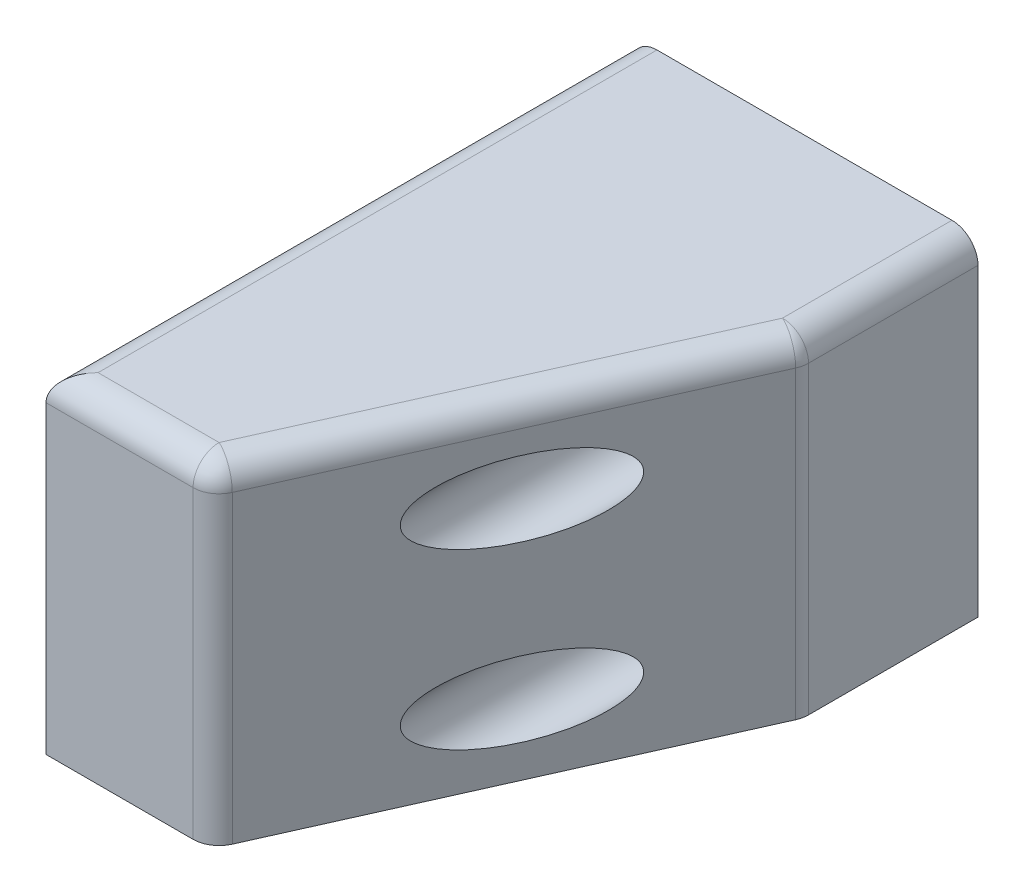
ISO-10303-21;
HEADER;
FILE_DESCRIPTION(('STEP AP214'),'2;1');
FILE_NAME('part.step','',(''),(''),'','','');
FILE_SCHEMA(('AUTOMOTIVE_DESIGN { 1 0 10303 214 1 1 1 1 }'));
ENDSEC;
DATA;
#1=APPLICATION_CONTEXT('core data for automotive mechanical design processes');
#2=APPLICATION_PROTOCOL_DEFINITION('international standard','automotive_design',2000,#1);
#3=PRODUCT_CONTEXT('',#1,'mechanical');
#4=PRODUCT('Part','Part','',(#3));
#5=PRODUCT_RELATED_PRODUCT_CATEGORY('part','',(#4));
#6=PRODUCT_DEFINITION_FORMATION('','',#4);
#7=PRODUCT_DEFINITION_CONTEXT('part definition',#1,'design');
#8=PRODUCT_DEFINITION('design','',#6,#7);
#9=PRODUCT_DEFINITION_SHAPE('','',#8);
#10=(LENGTH_UNIT() NAMED_UNIT(*) SI_UNIT(.MILLI.,.METRE.));
#11=(NAMED_UNIT(*) PLANE_ANGLE_UNIT() SI_UNIT($,.RADIAN.));
#12=(NAMED_UNIT(*) SI_UNIT($,.STERADIAN.) SOLID_ANGLE_UNIT());
#13=UNCERTAINTY_MEASURE_WITH_UNIT(LENGTH_MEASURE(1.E-05),#10,'distance_accuracy_value','');
#14=(GEOMETRIC_REPRESENTATION_CONTEXT(3) GLOBAL_UNCERTAINTY_ASSIGNED_CONTEXT((#13)) GLOBAL_UNIT_ASSIGNED_CONTEXT((#10,
#11,#12)) REPRESENTATION_CONTEXT('',''));
#15=CARTESIAN_POINT('',(0.,0.,0.));
#16=DIRECTION('',(0.,0.,1.));
#17=DIRECTION('',(1.,0.,0.));
#18=AXIS2_PLACEMENT_3D('',#15,#16,#17);
#19=CARTESIAN_POINT('',(-41.8,40.8867513459481,40.6));
#20=DIRECTION('',(0.,-0.866025403784439,-0.5));
#21=DIRECTION('',(0.,0.5,-0.866025403784439));
#22=AXIS2_PLACEMENT_3D('',#19,#20,#21);
#23=PLANE('',#22);
#24=DIRECTION('',(1.,0.,0.));
#25=VECTOR('',#24,1.);
#26=CARTESIAN_POINT('',(-41.8,40.8867513459481,40.6));
#27=LINE('',#26,#25);
#28=CARTESIAN_POINT('',(-41.8,40.8867513459481,40.6));
#29=VERTEX_POINT('',#28);
#30=CARTESIAN_POINT('',(-35.8,40.8867513459481,40.6));
#31=VERTEX_POINT('',#30);
#32=EDGE_CURVE('E209',#29,#31,#27,.T.);
#33=ORIENTED_EDGE('',*,*,#32,.F.);
#34=DIRECTION('',(0.,0.5,-0.866025403784439));
#35=VECTOR('',#34,1.);
#36=CARTESIAN_POINT('',(-41.8,40.8867513459481,40.6));
#37=LINE('',#36,#35);
#38=CARTESIAN_POINT('',(-41.8,43.7735026918962,35.6));
#39=VERTEX_POINT('',#38);
#40=EDGE_CURVE('E214',#29,#39,#37,.T.);
#41=ORIENTED_EDGE('',*,*,#40,.T.);
#42=DIRECTION('',(1.,0.,0.));
#43=VECTOR('',#42,1.);
#44=CARTESIAN_POINT('',(-41.8,43.7735026918962,35.6));
#45=LINE('',#44,#43);
#46=CARTESIAN_POINT('',(-35.8,43.7735026918962,35.6));
#47=VERTEX_POINT('',#46);
#48=EDGE_CURVE('E266',#39,#47,#45,.T.);
#49=ORIENTED_EDGE('',*,*,#48,.T.);
#50=DIRECTION('',(0.,0.5,-0.866025403784439));
#51=VECTOR('',#50,1.);
#52=CARTESIAN_POINT('',(-35.8,40.8867513459481,40.6));
#53=LINE('',#52,#51);
#54=EDGE_CURVE('E241',#31,#47,#53,.T.);
#55=ORIENTED_EDGE('',*,*,#54,.F.);
#56=EDGE_LOOP('',(#33,#41,#49,#55));
#57=FACE_BOUND('',#56,.T.);
#58=ADVANCED_FACE('F47',(#57),#23,.T.);
#59=CARTESIAN_POINT('',(-41.8,43.7735026918962,35.6));
#60=DIRECTION('',(0.,-0.866025403784439,0.5));
#61=DIRECTION('',(0.,-0.5,-0.866025403784439));
#62=AXIS2_PLACEMENT_3D('',#59,#60,#61);
#63=PLANE('',#62);
#64=ORIENTED_EDGE('',*,*,#48,.F.);
#65=DIRECTION('',(0.,-0.5,-0.866025403784439));
#66=VECTOR('',#65,1.);
#67=CARTESIAN_POINT('',(-41.8,43.7735026918962,35.6));
#68=LINE('',#67,#66);
#69=CARTESIAN_POINT('',(-41.8,40.8867513459481,30.6));
#70=VERTEX_POINT('',#69);
#71=EDGE_CURVE('E252',#39,#70,#68,.T.);
#72=ORIENTED_EDGE('',*,*,#71,.T.);
#73=DIRECTION('',(1.,0.,0.));
#74=VECTOR('',#73,1.);
#75=CARTESIAN_POINT('',(-41.8,40.8867513459481,30.6));
#76=LINE('',#75,#74);
#77=CARTESIAN_POINT('',(-35.8,40.8867513459481,30.6));
#78=VERTEX_POINT('',#77);
#79=EDGE_CURVE('E263',#70,#78,#76,.T.);
#80=ORIENTED_EDGE('',*,*,#79,.T.);
#81=DIRECTION('',(0.,-0.5,-0.866025403784439));
#82=VECTOR('',#81,1.);
#83=CARTESIAN_POINT('',(-35.8,43.7735026918962,35.6));
#84=LINE('',#83,#82);
#85=EDGE_CURVE('E244',#47,#78,#84,.T.);
#86=ORIENTED_EDGE('',*,*,#85,.F.);
#87=EDGE_LOOP('',(#64,#72,#80,#86));
#88=FACE_BOUND('',#87,.T.);
#89=ADVANCED_FACE('F511',(#88),#63,.T.);
#90=CARTESIAN_POINT('',(-41.8,40.8867513459481,30.6));
#91=DIRECTION('',(0.,0.,1.));
#92=DIRECTION('',(1.,0.,0.));
#93=AXIS2_PLACEMENT_3D('',#90,#91,#92);
#94=PLANE('',#93);
#95=ORIENTED_EDGE('',*,*,#79,.F.);
#96=DIRECTION('',(0.,-1.,0.));
#97=VECTOR('',#96,1.);
#98=CARTESIAN_POINT('',(-41.8,40.8867513459481,30.6));
#99=LINE('',#98,#97);
#100=CARTESIAN_POINT('',(-41.8,15.,30.6));
#101=VERTEX_POINT('',#100);
#102=EDGE_CURVE('E255',#70,#101,#99,.T.);
#103=ORIENTED_EDGE('',*,*,#102,.T.);
#104=DIRECTION('',(1.,0.,0.));
#105=VECTOR('',#104,1.);
#106=CARTESIAN_POINT('',(-41.8,15.,30.6));
#107=LINE('',#106,#105);
#108=CARTESIAN_POINT('',(-35.8,15.,30.6));
#109=VERTEX_POINT('',#108);
#110=EDGE_CURVE('E235',#101,#109,#107,.T.);
#111=ORIENTED_EDGE('',*,*,#110,.T.);
#112=DIRECTION('',(0.,-1.,0.));
#113=VECTOR('',#112,1.);
#114=CARTESIAN_POINT('',(-35.8,40.8867513459481,30.6));
#115=LINE('',#114,#113);
#116=EDGE_CURVE('E215',#78,#109,#115,.T.);
#117=ORIENTED_EDGE('',*,*,#116,.F.);
#118=EDGE_LOOP('',(#95,#103,#111,#117));
#119=FACE_BOUND('',#118,.T.);
#120=ADVANCED_FACE('F514',(#119),#94,.T.);
#121=CARTESIAN_POINT('',(-41.8,35.1132486540519,40.6));
#122=DIRECTION('',(0.,0.,-1.));
#123=DIRECTION('',(-1.,0.,0.));
#124=AXIS2_PLACEMENT_3D('',#121,#122,#123);
#125=PLANE('',#124);
#126=DIRECTION('',(0.,1.,0.));
#127=VECTOR('',#126,1.);
#128=CARTESIAN_POINT('',(-35.8,35.1132486540519,40.6));
#129=LINE('',#128,#127);
#130=CARTESIAN_POINT('',(-35.8,15.,40.6));
#131=VERTEX_POINT('',#130);
#132=EDGE_CURVE('E202',#131,#31,#129,.T.);
#133=ORIENTED_EDGE('',*,*,#132,.F.);
#134=DIRECTION('',(-1.,0.,0.));
#135=VECTOR('',#134,1.);
#136=CARTESIAN_POINT('',(-41.8,15.,40.6));
#137=LINE('',#136,#135);
#138=CARTESIAN_POINT('',(-41.8,15.,40.6));
#139=VERTEX_POINT('',#138);
#140=EDGE_CURVE('E206',#131,#139,#137,.T.);
#141=ORIENTED_EDGE('',*,*,#140,.T.);
#142=DIRECTION('',(0.,1.,0.));
#143=VECTOR('',#142,1.);
#144=CARTESIAN_POINT('',(-41.8,35.1132486540519,40.6));
#145=LINE('',#144,#143);
#146=EDGE_CURVE('E258',#139,#29,#145,.T.);
#147=ORIENTED_EDGE('',*,*,#146,.T.);
#148=ORIENTED_EDGE('',*,*,#32,.T.);
#149=EDGE_LOOP('',(#133,#141,#147,#148));
#150=FACE_BOUND('',#149,.T.);
#151=ADVANCED_FACE('F204',(#150),#125,.T.);
#152=CARTESIAN_POINT('',(-41.8,0.,0.));
#153=DIRECTION('',(-1.,0.,0.));
#154=DIRECTION('',(0.,0.,1.));
#155=AXIS2_PLACEMENT_3D('',#152,#153,#154);
#156=PLANE('',#155);
#157=CARTESIAN_POINT('',(-41.8,38.,35.6));
#158=DIRECTION('',(-1.,0.,0.));
#159=DIRECTION('',(0.,0.,1.));
#160=AXIS2_PLACEMENT_3D('',#157,#158,#159);
#161=CIRCLE('',#160,3.25);
#162=CARTESIAN_POINT('',(-41.8,38.,38.85));
#163=VERTEX_POINT('',#162);
#164=EDGE_CURVE('E226',#163,#163,#161,.F.);
#165=ORIENTED_EDGE('',*,*,#164,.F.);
#166=EDGE_LOOP('',(#165));
#167=FACE_BOUND('',#166,.T.);
#168=ORIENTED_EDGE('',*,*,#146,.F.);
#169=DIRECTION('',(0.,0.,-1.));
#170=VECTOR('',#169,1.);
#171=CARTESIAN_POINT('',(-41.8,15.,40.6));
#172=LINE('',#171,#170);
#173=EDGE_CURVE('E231',#139,#101,#172,.T.);
#174=ORIENTED_EDGE('',*,*,#173,.T.);
#175=ORIENTED_EDGE('',*,*,#102,.F.);
#176=ORIENTED_EDGE('',*,*,#71,.F.);
#177=ORIENTED_EDGE('',*,*,#40,.F.);
#178=EDGE_LOOP('',(#168,#174,#175,#176,#177));
#179=FACE_BOUND('',#178,.T.);
#180=ADVANCED_FACE('F501',(#167,#179),#156,.F.);
#181=CARTESIAN_POINT('',(-35.8,0.,0.));
#182=DIRECTION('',(-1.,0.,0.));
#183=DIRECTION('',(0.,0.,1.));
#184=AXIS2_PLACEMENT_3D('',#181,#182,#183);
#185=PLANE('',#184);
#186=DIRECTION('',(0.,0.,1.));
#187=VECTOR('',#186,1.);
#188=CARTESIAN_POINT('',(-35.8,15.,40.6));
#189=LINE('',#188,#187);
#190=EDGE_CURVE('E218',#109,#131,#189,.T.);
#191=ORIENTED_EDGE('',*,*,#190,.T.);
#192=ORIENTED_EDGE('',*,*,#132,.T.);
#193=ORIENTED_EDGE('',*,*,#54,.T.);
#194=ORIENTED_EDGE('',*,*,#85,.T.);
#195=ORIENTED_EDGE('',*,*,#116,.T.);
#196=EDGE_LOOP('',(#191,#192,#193,#194,#195));
#197=FACE_BOUND('',#196,.T.);
#198=ADVANCED_FACE('F219',(#197),#185,.T.);
#199=CARTESIAN_POINT('',(0.,0.,85.62));
#200=DIRECTION('',(0.,1.,0.));
#201=DIRECTION('',(-1.,0.,0.));
#202=AXIS2_PLACEMENT_3D('',#199,#200,#201);
#203=PLANE('',#202);
#204=DIRECTION('',(-0.407832100404226,0.,0.913056941203492));
#205=VECTOR('',#204,1.);
#206=CARTESIAN_POINT('',(-26.8,0.,85.62));
#207=LINE('',#206,#205);
#208=CARTESIAN_POINT('',(-0.331253054014699,0.,26.3616113149583));
#209=VERTEX_POINT('',#208);
#210=CARTESIAN_POINT('',(-25.7922486684679,0.,83.3638403025401));
#211=VERTEX_POINT('',#210);
#212=EDGE_CURVE('E359',#209,#211,#207,.T.);
#213=ORIENTED_EDGE('',*,*,#212,.T.);
#214=CARTESIAN_POINT('',(-29.2709956144532,0.,81.81));
#215=DIRECTION('',(0.,1.,0.));
#216=DIRECTION('',(-1.,0.,0.));
#217=AXIS2_PLACEMENT_3D('',#214,#215,#216);
#218=CIRCLE('',#217,3.81);
#219=CARTESIAN_POINT('',(-29.2709956144532,0.,85.62));
#220=VERTEX_POINT('',#219);
#221=EDGE_CURVE('E449',#211,#220,#218,.F.);
#222=ORIENTED_EDGE('',*,*,#221,.T.);
#223=DIRECTION('',(1.,0.,0.));
#224=VECTOR('',#223,1.);
#225=CARTESIAN_POINT('',(0.,0.,85.62));
#226=LINE('',#225,#224);
#227=CARTESIAN_POINT('',(-50.8,0.,85.62));
#228=VERTEX_POINT('',#227);
#229=EDGE_CURVE('E384',#228,#220,#226,.T.);
#230=ORIENTED_EDGE('',*,*,#229,.F.);
#231=DIRECTION('',(0.,0.,-1.));
#232=VECTOR('',#231,1.);
#233=CARTESIAN_POINT('',(-50.8,0.,85.62));
#234=LINE('',#233,#232);
#235=CARTESIAN_POINT('',(-50.8,0.,0.));
#236=VERTEX_POINT('',#235);
#237=EDGE_CURVE('E392',#228,#236,#234,.T.);
#238=ORIENTED_EDGE('',*,*,#237,.T.);
#239=DIRECTION('',(1.,0.,0.));
#240=VECTOR('',#239,1.);
#241=CARTESIAN_POINT('',(0.,0.,0.));
#242=LINE('',#241,#240);
#243=CARTESIAN_POINT('',(-43.8,0.,0.));
#244=VERTEX_POINT('',#243);
#245=EDGE_CURVE('E393',#236,#244,#242,.T.);
#246=ORIENTED_EDGE('',*,*,#245,.T.);
#247=DIRECTION('',(0.,0.,-1.));
#248=VECTOR('',#247,1.);
#249=CARTESIAN_POINT('',(-43.8,0.,70.));
#250=LINE('',#249,#248);
#251=CARTESIAN_POINT('',(-43.8,0.,70.));
#252=VERTEX_POINT('',#251);
#253=EDGE_CURVE('E327',#252,#244,#250,.T.);
#254=ORIENTED_EDGE('',*,*,#253,.F.);
#255=DIRECTION('',(-1.,0.,0.));
#256=VECTOR('',#255,1.);
#257=CARTESIAN_POINT('',(-43.8,0.,70.));
#258=LINE('',#257,#256);
#259=CARTESIAN_POINT('',(-33.8,0.,70.));
#260=VERTEX_POINT('',#259);
#261=EDGE_CURVE('E294',#260,#252,#258,.T.);
#262=ORIENTED_EDGE('',*,*,#261,.F.);
#263=DIRECTION('',(0.,0.,-1.));
#264=VECTOR('',#263,1.);
#265=CARTESIAN_POINT('',(-33.8,0.,70.));
#266=LINE('',#265,#264);
#267=CARTESIAN_POINT('',(-33.8,0.,0.));
#268=VERTEX_POINT('',#267);
#269=EDGE_CURVE('E355',#260,#268,#266,.T.);
#270=ORIENTED_EDGE('',*,*,#269,.T.);
#271=CARTESIAN_POINT('',(0.,0.,0.));
#272=VERTEX_POINT('',#271);
#273=EDGE_CURVE('E383',#268,#272,#242,.T.);
#274=ORIENTED_EDGE('',*,*,#273,.T.);
#275=DIRECTION('',(0.,0.,-1.));
#276=VECTOR('',#275,1.);
#277=CARTESIAN_POINT('',(0.,0.,85.62));
#278=LINE('',#277,#276);
#279=CARTESIAN_POINT('',(0.,0.,24.8077710124182));
#280=VERTEX_POINT('',#279);
#281=EDGE_CURVE('E409',#280,#272,#278,.T.);
#282=ORIENTED_EDGE('',*,*,#281,.F.);
#283=CARTESIAN_POINT('',(-3.81,0.,24.8077710124182));
#284=DIRECTION('',(0.,1.,0.));
#285=DIRECTION('',(-1.,0.,0.));
#286=AXIS2_PLACEMENT_3D('',#283,#284,#285);
#287=CIRCLE('',#286,3.81);
#288=EDGE_CURVE('E446',#280,#209,#287,.F.);
#289=ORIENTED_EDGE('',*,*,#288,.T.);
#290=EDGE_LOOP('',(#213,#222,#230,#238,#246,#254,#262,#270,#274,#282,#289));
#291=FACE_BOUND('',#290,.T.);
#292=ADVANCED_FACE('F605',(#291),#203,.F.);
#293=CARTESIAN_POINT('',(0.,0.,85.62));
#294=DIRECTION('',(-1.,0.,0.));
#295=DIRECTION('',(0.,0.,1.));
#296=AXIS2_PLACEMENT_3D('',#293,#294,#295);
#297=PLANE('',#296);
#298=DIRECTION('',(0.,0.,-1.));
#299=VECTOR('',#298,1.);
#300=CARTESIAN_POINT('',(0.,44.59,85.62));
#301=LINE('',#300,#299);
#302=CARTESIAN_POINT('',(0.,44.59,0.));
#303=VERTEX_POINT('',#302);
#304=CARTESIAN_POINT('',(0.,44.59,24.8077710124182));
#305=VERTEX_POINT('',#304);
#306=EDGE_CURVE('E71',#303,#305,#301,.F.);
#307=ORIENTED_EDGE('',*,*,#306,.T.);
#308=DIRECTION('',(0.,1.,0.));
#309=VECTOR('',#308,1.);
#310=CARTESIAN_POINT('',(0.,0.,24.8077710124182));
#311=LINE('',#310,#309);
#312=EDGE_CURVE('E454',#305,#280,#311,.F.);
#313=ORIENTED_EDGE('',*,*,#312,.T.);
#314=ORIENTED_EDGE('',*,*,#281,.T.);
#315=DIRECTION('',(0.,1.,0.));
#316=VECTOR('',#315,1.);
#317=CARTESIAN_POINT('',(0.,0.,0.));
#318=LINE('',#317,#316);
#319=EDGE_CURVE('E397',#272,#303,#318,.T.);
#320=ORIENTED_EDGE('',*,*,#319,.T.);
#321=EDGE_LOOP('',(#307,#313,#314,#320));
#322=FACE_BOUND('',#321,.T.);
#323=ADVANCED_FACE('F601',(#322),#297,.F.);
#324=CARTESIAN_POINT('',(0.,48.4,85.62));
#325=DIRECTION('',(0.,-1.,0.));
#326=DIRECTION('',(1.,0.,0.));
#327=AXIS2_PLACEMENT_3D('',#324,#325,#326);
#328=PLANE('',#327);
#329=DIRECTION('',(-0.407832100404226,0.,0.913056941203492));
#330=VECTOR('',#329,1.);
#331=CARTESIAN_POINT('',(-25.821182753166,48.4,74.0865383702525));
#332=LINE('',#331,#330);
#333=CARTESIAN_POINT('',(-29.2709956144532,48.4,81.81));
#334=VERTEX_POINT('',#333);
#335=CARTESIAN_POINT('',(-3.81,48.4,24.8077710124182));
#336=VERTEX_POINT('',#335);
#337=EDGE_CURVE('E431',#334,#336,#332,.F.);
#338=ORIENTED_EDGE('',*,*,#337,.T.);
#339=DIRECTION('',(0.,0.,-1.));
#340=VECTOR('',#339,1.);
#341=CARTESIAN_POINT('',(-3.81,48.4,85.62));
#342=LINE('',#341,#340);
#343=CARTESIAN_POINT('',(-3.81,48.4,0.));
#344=VERTEX_POINT('',#343);
#345=EDGE_CURVE('E434',#336,#344,#342,.T.);
#346=ORIENTED_EDGE('',*,*,#345,.T.);
#347=DIRECTION('',(-1.,0.,0.));
#348=VECTOR('',#347,1.);
#349=CARTESIAN_POINT('',(0.,48.4,0.));
#350=LINE('',#349,#348);
#351=CARTESIAN_POINT('',(-46.99,48.4,0.));
#352=VERTEX_POINT('',#351);
#353=EDGE_CURVE('E400',#344,#352,#350,.T.);
#354=ORIENTED_EDGE('',*,*,#353,.T.);
#355=DIRECTION('',(0.,0.,-1.));
#356=VECTOR('',#355,1.);
#357=CARTESIAN_POINT('',(-46.99,48.4,85.62));
#358=LINE('',#357,#356);
#359=CARTESIAN_POINT('',(-46.99,48.4,81.81));
#360=VERTEX_POINT('',#359);
#361=EDGE_CURVE('E425',#352,#360,#358,.F.);
#362=ORIENTED_EDGE('',*,*,#361,.T.);
#363=DIRECTION('',(-1.,0.,0.));
#364=VECTOR('',#363,1.);
#365=CARTESIAN_POINT('',(0.,48.4,81.81));
#366=LINE('',#365,#364);
#367=EDGE_CURVE('E428',#360,#334,#366,.F.);
#368=ORIENTED_EDGE('',*,*,#367,.T.);
#369=EDGE_LOOP('',(#338,#346,#354,#362,#368));
#370=FACE_BOUND('',#369,.T.);
#371=ADVANCED_FACE('F597',(#370),#328,.F.);
#372=CARTESIAN_POINT('',(-50.8,0.,85.62));
#373=DIRECTION('',(1.,0.,0.));
#374=DIRECTION('',(0.,0.,-1.));
#375=AXIS2_PLACEMENT_3D('',#372,#373,#374);
#376=PLANE('',#375);
#377=CARTESIAN_POINT('',(-50.8,38.,35.6));
#378=DIRECTION('',(-1.,0.,0.));
#379=DIRECTION('',(0.,0.,1.));
#380=AXIS2_PLACEMENT_3D('',#377,#378,#379);
#381=CIRCLE('',#380,3.25);
#382=CARTESIAN_POINT('',(-50.8,38.,38.85));
#383=VERTEX_POINT('',#382);
#384=EDGE_CURVE('E488',#383,#383,#381,.T.);
#385=ORIENTED_EDGE('',*,*,#384,.F.);
#386=EDGE_LOOP('',(#385));
#387=FACE_BOUND('',#386,.T.);
#388=DIRECTION('',(0.,-1.,0.));
#389=VECTOR('',#388,1.);
#390=CARTESIAN_POINT('',(-50.8,0.,85.62));
#391=LINE('',#390,#389);
#392=CARTESIAN_POINT('',(-50.8,44.59,85.62));
#393=VERTEX_POINT('',#392);
#394=EDGE_CURVE('E388',#393,#228,#391,.T.);
#395=ORIENTED_EDGE('',*,*,#394,.F.);
#396=DIRECTION('',(0.,0.,-1.));
#397=VECTOR('',#396,1.);
#398=CARTESIAN_POINT('',(-50.8,44.59,85.62));
#399=LINE('',#398,#397);
#400=CARTESIAN_POINT('',(-50.8,44.59,0.));
#401=VERTEX_POINT('',#400);
#402=EDGE_CURVE('E11',#393,#401,#399,.T.);
#403=ORIENTED_EDGE('',*,*,#402,.T.);
#404=DIRECTION('',(0.,-1.,0.));
#405=VECTOR('',#404,1.);
#406=CARTESIAN_POINT('',(-50.8,0.,0.));
#407=LINE('',#406,#405);
#408=EDGE_CURVE('E389',#401,#236,#407,.T.);
#409=ORIENTED_EDGE('',*,*,#408,.T.);
#410=ORIENTED_EDGE('',*,*,#237,.F.);
#411=EDGE_LOOP('',(#395,#403,#409,#410));
#412=FACE_BOUND('',#411,.T.);
#413=ADVANCED_FACE('F590',(#387,#412),#376,.F.);
#414=CARTESIAN_POINT('',(0.,0.,85.62));
#415=DIRECTION('',(0.,0.,-1.));
#416=DIRECTION('',(-1.,0.,0.));
#417=AXIS2_PLACEMENT_3D('',#414,#415,#416);
#418=PLANE('',#417);
#419=DIRECTION('',(0.,1.,0.));
#420=VECTOR('',#419,1.);
#421=CARTESIAN_POINT('',(-29.2709956144532,0.,85.62));
#422=LINE('',#421,#420);
#423=CARTESIAN_POINT('',(-29.2709956144532,44.59,85.62));
#424=VERTEX_POINT('',#423);
#425=EDGE_CURVE('E412',#220,#424,#422,.T.);
#426=ORIENTED_EDGE('',*,*,#425,.T.);
#427=DIRECTION('',(-1.,0.,0.));
#428=VECTOR('',#427,1.);
#429=CARTESIAN_POINT('',(0.,44.59,85.62));
#430=LINE('',#429,#428);
#431=EDGE_CURVE('E421',#424,#393,#430,.T.);
#432=ORIENTED_EDGE('',*,*,#431,.T.);
#433=ORIENTED_EDGE('',*,*,#394,.T.);
#434=ORIENTED_EDGE('',*,*,#229,.T.);
#435=EDGE_LOOP('',(#426,#432,#433,#434));
#436=FACE_BOUND('',#435,.T.);
#437=ADVANCED_FACE('F587',(#436),#418,.F.);
#438=CARTESIAN_POINT('',(0.,0.,0.));
#439=DIRECTION('',(0.,0.,-1.));
#440=DIRECTION('',(-1.,0.,0.));
#441=AXIS2_PLACEMENT_3D('',#438,#439,#440);
#442=PLANE('',#441);
#443=CARTESIAN_POINT('',(-12.7,35.7,0.));
#444=DIRECTION('',(0.,0.,1.));
#445=DIRECTION('',(1.,0.,0.));
#446=AXIS2_PLACEMENT_3D('',#443,#444,#445);
#447=CIRCLE('',#446,3.25);
#448=CARTESIAN_POINT('',(-9.45,35.7,0.));
#449=VERTEX_POINT('',#448);
#450=EDGE_CURVE('E270',#449,#449,#447,.T.);
#451=ORIENTED_EDGE('',*,*,#450,.T.);
#452=EDGE_LOOP('',(#451));
#453=FACE_BOUND('',#452,.T.);
#454=CARTESIAN_POINT('',(-12.7,10.3,0.));
#455=DIRECTION('',(0.,0.,1.));
#456=DIRECTION('',(1.,0.,0.));
#457=AXIS2_PLACEMENT_3D('',#454,#455,#456);
#458=CIRCLE('',#457,3.25);
#459=CARTESIAN_POINT('',(-9.45,10.3,0.));
#460=VERTEX_POINT('',#459);
#461=EDGE_CURVE('E269',#460,#460,#458,.T.);
#462=ORIENTED_EDGE('',*,*,#461,.T.);
#463=EDGE_LOOP('',(#462));
#464=FACE_BOUND('',#463,.T.);
#465=ORIENTED_EDGE('',*,*,#353,.F.);
#466=CARTESIAN_POINT('',(-3.81,44.59,0.));
#467=DIRECTION('',(0.,0.,-1.));
#468=DIRECTION('',(-1.,0.,0.));
#469=AXIS2_PLACEMENT_3D('',#466,#467,#468);
#470=CIRCLE('',#469,3.81);
#471=EDGE_CURVE('E57',#344,#303,#470,.T.);
#472=ORIENTED_EDGE('',*,*,#471,.T.);
#473=ORIENTED_EDGE('',*,*,#319,.F.);
#474=ORIENTED_EDGE('',*,*,#273,.F.);
#475=DIRECTION('',(0.,-1.,0.));
#476=VECTOR('',#475,1.);
#477=CARTESIAN_POINT('',(-33.8,2.99999999999999,0.));
#478=LINE('',#477,#476);
#479=CARTESIAN_POINT('',(-33.8,2.99999999999999,0.));
#480=VERTEX_POINT('',#479);
#481=EDGE_CURVE('E299',#480,#268,#478,.T.);
#482=ORIENTED_EDGE('',*,*,#481,.F.);
#483=DIRECTION('',(-1.,0.,0.));
#484=VECTOR('',#483,1.);
#485=CARTESIAN_POINT('',(-30.8,2.99999999999999,0.));
#486=LINE('',#485,#484);
#487=CARTESIAN_POINT('',(-30.8,2.99999999999999,0.));
#488=VERTEX_POINT('',#487);
#489=EDGE_CURVE('E349',#488,#480,#486,.T.);
#490=ORIENTED_EDGE('',*,*,#489,.F.);
#491=DIRECTION('',(0.,-1.,0.));
#492=VECTOR('',#491,1.);
#493=CARTESIAN_POINT('',(-30.8,15.,0.));
#494=LINE('',#493,#492);
#495=CARTESIAN_POINT('',(-30.8,15.,0.));
#496=VERTEX_POINT('',#495);
#497=EDGE_CURVE('E345',#496,#488,#494,.T.);
#498=ORIENTED_EDGE('',*,*,#497,.F.);
#499=DIRECTION('',(1.,0.,0.));
#500=VECTOR('',#499,1.);
#501=CARTESIAN_POINT('',(-46.8,15.,0.));
#502=LINE('',#501,#500);
#503=CARTESIAN_POINT('',(-46.8,15.,0.));
#504=VERTEX_POINT('',#503);
#505=EDGE_CURVE('E341',#504,#496,#502,.T.);
#506=ORIENTED_EDGE('',*,*,#505,.F.);
#507=DIRECTION('',(0.,1.,0.));
#508=VECTOR('',#507,1.);
#509=CARTESIAN_POINT('',(-46.8,2.99999999999999,0.));
#510=LINE('',#509,#508);
#511=CARTESIAN_POINT('',(-46.8,2.99999999999999,0.));
#512=VERTEX_POINT('',#511);
#513=EDGE_CURVE('E337',#512,#504,#510,.T.);
#514=ORIENTED_EDGE('',*,*,#513,.F.);
#515=DIRECTION('',(-1.,0.,0.));
#516=VECTOR('',#515,1.);
#517=CARTESIAN_POINT('',(-43.8,2.99999999999999,0.));
#518=LINE('',#517,#516);
#519=CARTESIAN_POINT('',(-43.8,2.99999999999999,0.));
#520=VERTEX_POINT('',#519);
#521=EDGE_CURVE('E332',#520,#512,#518,.T.);
#522=ORIENTED_EDGE('',*,*,#521,.F.);
#523=DIRECTION('',(0.,1.,0.));
#524=VECTOR('',#523,1.);
#525=CARTESIAN_POINT('',(-43.8,0.,0.));
#526=LINE('',#525,#524);
#527=EDGE_CURVE('E328',#244,#520,#526,.T.);
#528=ORIENTED_EDGE('',*,*,#527,.F.);
#529=ORIENTED_EDGE('',*,*,#245,.F.);
#530=ORIENTED_EDGE('',*,*,#408,.F.);
#531=CARTESIAN_POINT('',(-46.99,44.59,0.));
#532=DIRECTION('',(0.,0.,-1.));
#533=DIRECTION('',(-1.,0.,0.));
#534=AXIS2_PLACEMENT_3D('',#531,#532,#533);
#535=CIRCLE('',#534,3.81);
#536=EDGE_CURVE('E457',#401,#352,#535,.T.);
#537=ORIENTED_EDGE('',*,*,#536,.T.);
#538=EDGE_LOOP('',(#465,#472,#473,#474,#482,#490,#498,#506,#514,#522,#528,#529,#530,#537));
#539=FACE_BOUND('',#538,.T.);
#540=ADVANCED_FACE('F585',(#453,#464,#539),#442,.T.);
#541=CARTESIAN_POINT('',(-26.8,0.,85.62));
#542=DIRECTION('',(-0.913056941203492,0.,-0.407832100404226));
#543=DIRECTION('',(-0.407832100404226,0.,0.913056941203492));
#544=AXIS2_PLACEMENT_3D('',#541,#542,#543);
#545=PLANE('',#544);
#546=CARTESIAN_POINT('',(-12.7,10.3,54.0528358208955));
#547=DIRECTION('',(-0.913056941203492,0.,-0.407832100404226));
#548=DIRECTION('',(-0.407832100404226,0.,0.913056941203492));
#549=AXIS2_PLACEMENT_3D('',#546,#547,#548);
#550=ELLIPSE('',#549,13.4859418730125,5.5);
#551=CARTESIAN_POINT('',(-18.2,10.3,66.3662686567164));
#552=VERTEX_POINT('',#551);
#553=EDGE_CURVE('E333',#552,#552,#550,.T.);
#554=ORIENTED_EDGE('',*,*,#553,.T.);
#555=EDGE_LOOP('',(#554));
#556=FACE_BOUND('',#555,.T.);
#557=CARTESIAN_POINT('',(-12.7,35.7,54.0528358208955));
#558=DIRECTION('',(-0.913056941203492,0.,-0.407832100404226));
#559=DIRECTION('',(-0.407832100404226,0.,0.913056941203492));
#560=AXIS2_PLACEMENT_3D('',#557,#558,#559);
#561=ELLIPSE('',#560,13.4859418730125,5.5);
#562=CARTESIAN_POINT('',(-18.2,35.7,66.3662686567164));
#563=VERTEX_POINT('',#562);
#564=EDGE_CURVE('E290',#563,#563,#561,.T.);
#565=ORIENTED_EDGE('',*,*,#564,.T.);
#566=EDGE_LOOP('',(#565));
#567=FACE_BOUND('',#566,.T.);
#568=DIRECTION('',(-0.407832100404226,0.,0.913056941203492));
#569=VECTOR('',#568,1.);
#570=CARTESIAN_POINT('',(-26.8,44.59,85.62));
#571=LINE('',#570,#569);
#572=CARTESIAN_POINT('',(-0.331253054014696,44.59,26.3616113149583));
#573=VERTEX_POINT('',#572);
#574=CARTESIAN_POINT('',(-25.7922486684679,44.59,83.3638403025401));
#575=VERTEX_POINT('',#574);
#576=EDGE_CURVE('E437',#573,#575,#571,.T.);
#577=ORIENTED_EDGE('',*,*,#576,.T.);
#578=DIRECTION('',(0.,1.,0.));
#579=VECTOR('',#578,1.);
#580=CARTESIAN_POINT('',(-25.7922486684679,0.,83.3638403025401));
#581=LINE('',#580,#579);
#582=EDGE_CURVE('E443',#575,#211,#581,.F.);
#583=ORIENTED_EDGE('',*,*,#582,.T.);
#584=ORIENTED_EDGE('',*,*,#212,.F.);
#585=DIRECTION('',(0.,1.,0.));
#586=VECTOR('',#585,1.);
#587=CARTESIAN_POINT('',(-0.331253054014689,0.,26.3616113149583));
#588=LINE('',#587,#586);
#589=EDGE_CURVE('E440',#209,#573,#588,.T.);
#590=ORIENTED_EDGE('',*,*,#589,.T.);
#591=EDGE_LOOP('',(#577,#583,#584,#590));
#592=FACE_BOUND('',#591,.T.);
#593=ADVANCED_FACE('F561',(#556,#567,#592),#545,.F.);
#594=CARTESIAN_POINT('',(-33.8,2.99999999999999,70.));
#595=DIRECTION('',(1.,0.,0.));
#596=DIRECTION('',(0.,0.,-1.));
#597=AXIS2_PLACEMENT_3D('',#594,#595,#596);
#598=PLANE('',#597);
#599=ORIENTED_EDGE('',*,*,#481,.T.);
#600=ORIENTED_EDGE('',*,*,#269,.F.);
#601=DIRECTION('',(0.,-1.,0.));
#602=VECTOR('',#601,1.);
#603=CARTESIAN_POINT('',(-33.8,2.99999999999999,70.));
#604=LINE('',#603,#602);
#605=CARTESIAN_POINT('',(-33.8,2.99999999999999,70.));
#606=VERTEX_POINT('',#605);
#607=EDGE_CURVE('E323',#606,#260,#604,.T.);
#608=ORIENTED_EDGE('',*,*,#607,.F.);
#609=DIRECTION('',(0.,0.,-1.));
#610=VECTOR('',#609,1.);
#611=CARTESIAN_POINT('',(-33.8,2.99999999999999,70.));
#612=LINE('',#611,#610);
#613=EDGE_CURVE('E360',#606,#480,#612,.T.);
#614=ORIENTED_EDGE('',*,*,#613,.T.);
#615=EDGE_LOOP('',(#599,#600,#608,#614));
#616=FACE_BOUND('',#615,.T.);
#617=ADVANCED_FACE('F557',(#616),#598,.F.);
#618=CARTESIAN_POINT('',(-30.8,2.99999999999999,70.));
#619=DIRECTION('',(0.,-1.,0.));
#620=DIRECTION('',(0.,0.,-1.));
#621=AXIS2_PLACEMENT_3D('',#618,#619,#620);
#622=PLANE('',#621);
#623=ORIENTED_EDGE('',*,*,#489,.T.);
#624=ORIENTED_EDGE('',*,*,#613,.F.);
#625=DIRECTION('',(-1.,0.,0.));
#626=VECTOR('',#625,1.);
#627=CARTESIAN_POINT('',(-30.8,2.99999999999999,70.));
#628=LINE('',#627,#626);
#629=CARTESIAN_POINT('',(-30.8,2.99999999999999,70.));
#630=VERTEX_POINT('',#629);
#631=EDGE_CURVE('E319',#630,#606,#628,.T.);
#632=ORIENTED_EDGE('',*,*,#631,.F.);
#633=DIRECTION('',(0.,0.,-1.));
#634=VECTOR('',#633,1.);
#635=CARTESIAN_POINT('',(-30.8,2.99999999999999,70.));
#636=LINE('',#635,#634);
#637=EDGE_CURVE('E363',#630,#488,#636,.T.);
#638=ORIENTED_EDGE('',*,*,#637,.T.);
#639=EDGE_LOOP('',(#623,#624,#632,#638));
#640=FACE_BOUND('',#639,.T.);
#641=ADVANCED_FACE('F560',(#640),#622,.F.);
#642=CARTESIAN_POINT('',(-30.8,15.,70.));
#643=DIRECTION('',(1.,0.,0.));
#644=DIRECTION('',(0.,1.,0.));
#645=AXIS2_PLACEMENT_3D('',#642,#643,#644);
#646=PLANE('',#645);
#647=ORIENTED_EDGE('',*,*,#497,.T.);
#648=ORIENTED_EDGE('',*,*,#637,.F.);
#649=DIRECTION('',(0.,-1.,0.));
#650=VECTOR('',#649,1.);
#651=CARTESIAN_POINT('',(-30.8,15.,70.));
#652=LINE('',#651,#650);
#653=CARTESIAN_POINT('',(-30.8,15.,70.));
#654=VERTEX_POINT('',#653);
#655=EDGE_CURVE('E315',#654,#630,#652,.T.);
#656=ORIENTED_EDGE('',*,*,#655,.F.);
#657=DIRECTION('',(0.,0.,-1.));
#658=VECTOR('',#657,1.);
#659=CARTESIAN_POINT('',(-30.8,15.,70.));
#660=LINE('',#659,#658);
#661=EDGE_CURVE('E366',#654,#496,#660,.T.);
#662=ORIENTED_EDGE('',*,*,#661,.T.);
#663=EDGE_LOOP('',(#647,#648,#656,#662));
#664=FACE_BOUND('',#663,.T.);
#665=ADVANCED_FACE('F565',(#664),#646,.F.);
#666=CARTESIAN_POINT('',(-46.8,15.,70.));
#667=DIRECTION('',(0.,1.,0.));
#668=DIRECTION('',(0.,0.,1.));
#669=AXIS2_PLACEMENT_3D('',#666,#667,#668);
#670=PLANE('',#669);
#671=ORIENTED_EDGE('',*,*,#173,.F.);
#672=ORIENTED_EDGE('',*,*,#140,.F.);
#673=ORIENTED_EDGE('',*,*,#190,.F.);
#674=ORIENTED_EDGE('',*,*,#110,.F.);
#675=EDGE_LOOP('',(#671,#672,#673,#674));
#676=FACE_BOUND('',#675,.T.);
#677=ORIENTED_EDGE('',*,*,#505,.T.);
#678=ORIENTED_EDGE('',*,*,#661,.F.);
#679=DIRECTION('',(1.,0.,0.));
#680=VECTOR('',#679,1.);
#681=CARTESIAN_POINT('',(-46.8,15.,70.));
#682=LINE('',#681,#680);
#683=CARTESIAN_POINT('',(-46.8,15.,70.));
#684=VERTEX_POINT('',#683);
#685=EDGE_CURVE('E311',#684,#654,#682,.T.);
#686=ORIENTED_EDGE('',*,*,#685,.F.);
#687=DIRECTION('',(0.,0.,-1.));
#688=VECTOR('',#687,1.);
#689=CARTESIAN_POINT('',(-46.8,15.,70.));
#690=LINE('',#689,#688);
#691=EDGE_CURVE('E369',#684,#504,#690,.T.);
#692=ORIENTED_EDGE('',*,*,#691,.T.);
#693=EDGE_LOOP('',(#677,#678,#686,#692));
#694=FACE_BOUND('',#693,.T.);
#695=ADVANCED_FACE('F228',(#676,#694),#670,.F.);
#696=CARTESIAN_POINT('',(-46.8,2.99999999999999,70.));
#697=DIRECTION('',(-1.,0.,0.));
#698=DIRECTION('',(0.,-1.,0.));
#699=AXIS2_PLACEMENT_3D('',#696,#697,#698);
#700=PLANE('',#699);
#701=ORIENTED_EDGE('',*,*,#513,.T.);
#702=ORIENTED_EDGE('',*,*,#691,.F.);
#703=DIRECTION('',(0.,1.,0.));
#704=VECTOR('',#703,1.);
#705=CARTESIAN_POINT('',(-46.8,2.99999999999999,70.));
#706=LINE('',#705,#704);
#707=CARTESIAN_POINT('',(-46.8,2.99999999999999,70.));
#708=VERTEX_POINT('',#707);
#709=EDGE_CURVE('E307',#708,#684,#706,.T.);
#710=ORIENTED_EDGE('',*,*,#709,.F.);
#711=DIRECTION('',(0.,0.,-1.));
#712=VECTOR('',#711,1.);
#713=CARTESIAN_POINT('',(-46.8,2.99999999999999,70.));
#714=LINE('',#713,#712);
#715=EDGE_CURVE('E372',#708,#512,#714,.T.);
#716=ORIENTED_EDGE('',*,*,#715,.T.);
#717=EDGE_LOOP('',(#701,#702,#710,#716));
#718=FACE_BOUND('',#717,.T.);
#719=ADVANCED_FACE('F572',(#718),#700,.F.);
#720=CARTESIAN_POINT('',(-43.8,2.99999999999999,70.));
#721=DIRECTION('',(0.,-1.,0.));
#722=DIRECTION('',(0.,0.,-1.));
#723=AXIS2_PLACEMENT_3D('',#720,#721,#722);
#724=PLANE('',#723);
#725=ORIENTED_EDGE('',*,*,#521,.T.);
#726=ORIENTED_EDGE('',*,*,#715,.F.);
#727=DIRECTION('',(-1.,0.,0.));
#728=VECTOR('',#727,1.);
#729=CARTESIAN_POINT('',(-43.8,2.99999999999999,70.));
#730=LINE('',#729,#728);
#731=CARTESIAN_POINT('',(-43.8,2.99999999999999,70.));
#732=VERTEX_POINT('',#731);
#733=EDGE_CURVE('E303',#732,#708,#730,.T.);
#734=ORIENTED_EDGE('',*,*,#733,.F.);
#735=DIRECTION('',(0.,0.,-1.));
#736=VECTOR('',#735,1.);
#737=CARTESIAN_POINT('',(-43.8,2.99999999999999,70.));
#738=LINE('',#737,#736);
#739=EDGE_CURVE('E375',#732,#520,#738,.T.);
#740=ORIENTED_EDGE('',*,*,#739,.T.);
#741=EDGE_LOOP('',(#725,#726,#734,#740));
#742=FACE_BOUND('',#741,.T.);
#743=ADVANCED_FACE('F575',(#742),#724,.F.);
#744=CARTESIAN_POINT('',(-43.8,0.,70.));
#745=DIRECTION('',(-1.,0.,0.));
#746=DIRECTION('',(0.,0.,1.));
#747=AXIS2_PLACEMENT_3D('',#744,#745,#746);
#748=PLANE('',#747);
#749=ORIENTED_EDGE('',*,*,#527,.T.);
#750=ORIENTED_EDGE('',*,*,#739,.F.);
#751=DIRECTION('',(0.,1.,0.));
#752=VECTOR('',#751,1.);
#753=CARTESIAN_POINT('',(-43.8,0.,70.));
#754=LINE('',#753,#752);
#755=EDGE_CURVE('E298',#252,#732,#754,.T.);
#756=ORIENTED_EDGE('',*,*,#755,.F.);
#757=ORIENTED_EDGE('',*,*,#253,.T.);
#758=EDGE_LOOP('',(#749,#750,#756,#757));
#759=FACE_BOUND('',#758,.T.);
#760=ADVANCED_FACE('F555',(#759),#748,.F.);
#761=CARTESIAN_POINT('',(0.,0.,70.));
#762=DIRECTION('',(0.,0.,-1.));
#763=DIRECTION('',(-1.,0.,0.));
#764=AXIS2_PLACEMENT_3D('',#761,#762,#763);
#765=PLANE('',#764);
#766=ORIENTED_EDGE('',*,*,#261,.T.);
#767=ORIENTED_EDGE('',*,*,#755,.T.);
#768=ORIENTED_EDGE('',*,*,#733,.T.);
#769=ORIENTED_EDGE('',*,*,#709,.T.);
#770=ORIENTED_EDGE('',*,*,#685,.T.);
#771=ORIENTED_EDGE('',*,*,#655,.T.);
#772=ORIENTED_EDGE('',*,*,#631,.T.);
#773=ORIENTED_EDGE('',*,*,#607,.T.);
#774=EDGE_LOOP('',(#766,#767,#768,#769,#770,#771,#772,#773));
#775=FACE_BOUND('',#774,.T.);
#776=ADVANCED_FACE('F548',(#775),#765,.T.);
#777=CARTESIAN_POINT('',(-12.7,35.7,5.62));
#778=DIRECTION('',(0.,0.,1.));
#779=DIRECTION('',(1.,0.,0.));
#780=AXIS2_PLACEMENT_3D('',#777,#778,#779);
#781=CYLINDRICAL_SURFACE('',#780,5.5);
#782=CARTESIAN_POINT('',(-12.7,35.7,5.62));
#783=DIRECTION('',(0.,0.,1.));
#784=DIRECTION('',(1.,0.,0.));
#785=AXIS2_PLACEMENT_3D('',#782,#783,#784);
#786=CIRCLE('',#785,5.5);
#787=CARTESIAN_POINT('',(-7.2,35.7,5.62));
#788=VERTEX_POINT('',#787);
#789=EDGE_CURVE('E274',#788,#788,#786,.T.);
#790=ORIENTED_EDGE('',*,*,#789,.F.);
#791=EDGE_LOOP('',(#790));
#792=FACE_BOUND('',#791,.T.);
#793=ORIENTED_EDGE('',*,*,#564,.F.);
#794=EDGE_LOOP('',(#793));
#795=FACE_BOUND('',#794,.T.);
#796=ADVANCED_FACE('F545',(#792,#795),#781,.F.);
#797=CARTESIAN_POINT('',(-12.7,35.7,5.62));
#798=DIRECTION('',(0.,0.,1.));
#799=DIRECTION('',(1.,0.,0.));
#800=AXIS2_PLACEMENT_3D('',#797,#798,#799);
#801=PLANE('',#800);
#802=CARTESIAN_POINT('',(-12.7,35.7,5.62));
#803=DIRECTION('',(0.,0.,1.));
#804=DIRECTION('',(1.,0.,0.));
#805=AXIS2_PLACEMENT_3D('',#802,#803,#804);
#806=CIRCLE('',#805,3.25);
#807=CARTESIAN_POINT('',(-9.45,35.7,5.62));
#808=VERTEX_POINT('',#807);
#809=EDGE_CURVE('E275',#808,#808,#806,.T.);
#810=ORIENTED_EDGE('',*,*,#809,.F.);
#811=EDGE_LOOP('',(#810));
#812=FACE_BOUND('',#811,.T.);
#813=ORIENTED_EDGE('',*,*,#789,.T.);
#814=EDGE_LOOP('',(#813));
#815=FACE_BOUND('',#814,.T.);
#816=ADVANCED_FACE('F543',(#812,#815),#801,.T.);
#817=CARTESIAN_POINT('',(-12.7,10.3,5.62));
#818=DIRECTION('',(0.,0.,1.));
#819=DIRECTION('',(1.,0.,0.));
#820=AXIS2_PLACEMENT_3D('',#817,#818,#819);
#821=CYLINDRICAL_SURFACE('',#820,5.5);
#822=CARTESIAN_POINT('',(-12.7,10.3,5.62));
#823=DIRECTION('',(0.,0.,1.));
#824=DIRECTION('',(1.,0.,0.));
#825=AXIS2_PLACEMENT_3D('',#822,#823,#824);
#826=CIRCLE('',#825,5.5);
#827=CARTESIAN_POINT('',(-7.19999999999999,10.3,5.62));
#828=VERTEX_POINT('',#827);
#829=EDGE_CURVE('E286',#828,#828,#826,.T.);
#830=ORIENTED_EDGE('',*,*,#829,.F.);
#831=EDGE_LOOP('',(#830));
#832=FACE_BOUND('',#831,.T.);
#833=ORIENTED_EDGE('',*,*,#553,.F.);
#834=EDGE_LOOP('',(#833));
#835=FACE_BOUND('',#834,.T.);
#836=ADVANCED_FACE('F539',(#832,#835),#821,.F.);
#837=CARTESIAN_POINT('',(-12.7,10.3,5.62));
#838=DIRECTION('',(0.,0.,1.));
#839=DIRECTION('',(1.,0.,0.));
#840=AXIS2_PLACEMENT_3D('',#837,#838,#839);
#841=PLANE('',#840);
#842=CARTESIAN_POINT('',(-12.7,10.3,5.62));
#843=DIRECTION('',(0.,0.,1.));
#844=DIRECTION('',(1.,0.,0.));
#845=AXIS2_PLACEMENT_3D('',#842,#843,#844);
#846=CIRCLE('',#845,3.25);
#847=CARTESIAN_POINT('',(-9.45,10.3,5.62));
#848=VERTEX_POINT('',#847);
#849=EDGE_CURVE('E279',#848,#848,#846,.T.);
#850=ORIENTED_EDGE('',*,*,#849,.F.);
#851=EDGE_LOOP('',(#850));
#852=FACE_BOUND('',#851,.T.);
#853=ORIENTED_EDGE('',*,*,#829,.T.);
#854=EDGE_LOOP('',(#853));
#855=FACE_BOUND('',#854,.T.);
#856=ADVANCED_FACE('F535',(#852,#855),#841,.T.);
#857=CARTESIAN_POINT('',(-12.7,10.3,0.));
#858=DIRECTION('',(0.,0.,1.));
#859=DIRECTION('',(1.,0.,0.));
#860=AXIS2_PLACEMENT_3D('',#857,#858,#859);
#861=CYLINDRICAL_SURFACE('',#860,3.25);
#862=ORIENTED_EDGE('',*,*,#461,.F.);
#863=EDGE_LOOP('',(#862));
#864=FACE_BOUND('',#863,.T.);
#865=ORIENTED_EDGE('',*,*,#849,.T.);
#866=EDGE_LOOP('',(#865));
#867=FACE_BOUND('',#866,.T.);
#868=ADVANCED_FACE('F531',(#864,#867),#861,.F.);
#869=CARTESIAN_POINT('',(-12.7,35.7,0.));
#870=DIRECTION('',(0.,0.,1.));
#871=DIRECTION('',(1.,0.,0.));
#872=AXIS2_PLACEMENT_3D('',#869,#870,#871);
#873=CYLINDRICAL_SURFACE('',#872,3.25);
#874=ORIENTED_EDGE('',*,*,#450,.F.);
#875=EDGE_LOOP('',(#874));
#876=FACE_BOUND('',#875,.T.);
#877=ORIENTED_EDGE('',*,*,#809,.T.);
#878=EDGE_LOOP('',(#877));
#879=FACE_BOUND('',#878,.T.);
#880=ADVANCED_FACE('F529',(#876,#879),#873,.F.);
#881=CARTESIAN_POINT('',(0.00100000000001488,38.,35.6));
#882=DIRECTION('',(-1.,0.,0.));
#883=DIRECTION('',(0.,0.,1.));
#884=AXIS2_PLACEMENT_3D('',#881,#882,#883);
#885=CYLINDRICAL_SURFACE('',#884,3.25);
#886=ORIENTED_EDGE('',*,*,#384,.T.);
#887=EDGE_LOOP('',(#886));
#888=FACE_BOUND('',#887,.T.);
#889=ORIENTED_EDGE('',*,*,#164,.T.);
#890=EDGE_LOOP('',(#889));
#891=FACE_BOUND('',#890,.T.);
#892=ADVANCED_FACE('F499',(#888,#891),#885,.F.);
#893=CARTESIAN_POINT('',(-3.81,44.59,85.62));
#894=DIRECTION('',(0.,0.,-1.));
#895=DIRECTION('',(-1.,0.,0.));
#896=AXIS2_PLACEMENT_3D('',#893,#894,#895);
#897=CYLINDRICAL_SURFACE('',#896,3.81);
#898=ORIENTED_EDGE('',*,*,#471,.F.);
#899=ORIENTED_EDGE('',*,*,#345,.F.);
#900=CARTESIAN_POINT('',(-3.81,44.59,24.8077710124182));
#901=DIRECTION('',(0.,0.,1.));
#902=DIRECTION('',(0.,-1.,0.));
#903=AXIS2_PLACEMENT_3D('',#900,#901,#902);
#904=CIRCLE('',#903,3.81);
#905=EDGE_CURVE('E51',#305,#336,#904,.T.);
#906=ORIENTED_EDGE('',*,*,#905,.F.);
#907=ORIENTED_EDGE('',*,*,#306,.F.);
#908=EDGE_LOOP('',(#898,#899,#906,#907));
#909=FACE_BOUND('',#908,.T.);
#910=ADVANCED_FACE('F49',(#909),#897,.T.);
#911=CARTESIAN_POINT('',(-3.81,0.,24.8077710124182));
#912=DIRECTION('',(0.,1.,0.));
#913=DIRECTION('',(0.,0.,1.));
#914=AXIS2_PLACEMENT_3D('',#911,#912,#913);
#915=CYLINDRICAL_SURFACE('',#914,3.81);
#916=ORIENTED_EDGE('',*,*,#288,.F.);
#917=ORIENTED_EDGE('',*,*,#312,.F.);
#918=CARTESIAN_POINT('',(-3.81,44.59,24.8077710124182));
#919=DIRECTION('',(0.,1.,0.));
#920=DIRECTION('',(0.,0.,1.));
#921=AXIS2_PLACEMENT_3D('',#918,#919,#920);
#922=CIRCLE('',#921,3.81);
#923=EDGE_CURVE('E480',#573,#305,#922,.T.);
#924=ORIENTED_EDGE('',*,*,#923,.F.);
#925=ORIENTED_EDGE('',*,*,#589,.F.);
#926=EDGE_LOOP('',(#916,#917,#924,#925));
#927=FACE_BOUND('',#926,.T.);
#928=ADVANCED_FACE('F631',(#927),#915,.T.);
#929=CARTESIAN_POINT('',(-3.81,44.59,24.8077710124182));
#930=DIRECTION('',(0.,1.,0.));
#931=DIRECTION('',(0.,0.,1.));
#932=AXIS2_PLACEMENT_3D('',#929,#930,#931);
#933=SPHERICAL_SURFACE('',#932,3.81);
#934=ORIENTED_EDGE('',*,*,#923,.T.);
#935=ORIENTED_EDGE('',*,*,#905,.T.);
#936=CARTESIAN_POINT('',(-3.81,44.59,24.8077710124182));
#937=DIRECTION('',(0.407832100404228,0.,-0.913056941203491));
#938=DIRECTION('',(-0.913056941203491,0.,-0.407832100404228));
#939=AXIS2_PLACEMENT_3D('',#936,#937,#938);
#940=CIRCLE('',#939,3.81);
#941=EDGE_CURVE('E477',#573,#336,#940,.F.);
#942=ORIENTED_EDGE('',*,*,#941,.F.);
#943=EDGE_LOOP('',(#934,#935,#942));
#944=FACE_BOUND('',#943,.T.);
#945=ADVANCED_FACE('F628',(#944),#933,.T.);
#946=CARTESIAN_POINT('',(-30.2787469459853,44.59,84.0661596974599));
#947=DIRECTION('',(-0.407832100404226,0.,0.913056941203492));
#948=DIRECTION('',(0.913056941203492,0.,0.407832100404226));
#949=AXIS2_PLACEMENT_3D('',#946,#947,#948);
#950=CYLINDRICAL_SURFACE('',#949,3.81);
#951=ORIENTED_EDGE('',*,*,#941,.T.);
#952=ORIENTED_EDGE('',*,*,#337,.F.);
#953=CARTESIAN_POINT('',(-29.2709956144532,44.59,81.81));
#954=DIRECTION('',(-0.407832100404227,0.,0.913056941203492));
#955=DIRECTION('',(0.913056941203492,0.,0.407832100404227));
#956=AXIS2_PLACEMENT_3D('',#953,#954,#955);
#957=CIRCLE('',#956,3.81);
#958=EDGE_CURVE('E473',#575,#334,#957,.T.);
#959=ORIENTED_EDGE('',*,*,#958,.F.);
#960=ORIENTED_EDGE('',*,*,#576,.F.);
#961=EDGE_LOOP('',(#951,#952,#959,#960));
#962=FACE_BOUND('',#961,.T.);
#963=ADVANCED_FACE('F624',(#962),#950,.T.);
#964=CARTESIAN_POINT('',(-29.2709956144532,0.,81.81));
#965=DIRECTION('',(0.,1.,0.));
#966=DIRECTION('',(-1.,0.,0.));
#967=AXIS2_PLACEMENT_3D('',#964,#965,#966);
#968=CYLINDRICAL_SURFACE('',#967,3.81);
#969=ORIENTED_EDGE('',*,*,#221,.F.);
#970=ORIENTED_EDGE('',*,*,#582,.F.);
#971=CARTESIAN_POINT('',(-29.2709956144532,44.59,81.81));
#972=DIRECTION('',(0.,1.,0.));
#973=DIRECTION('',(0.,0.,1.));
#974=AXIS2_PLACEMENT_3D('',#971,#972,#973);
#975=CIRCLE('',#974,3.81);
#976=EDGE_CURVE('E469',#424,#575,#975,.T.);
#977=ORIENTED_EDGE('',*,*,#976,.F.);
#978=ORIENTED_EDGE('',*,*,#425,.F.);
#979=EDGE_LOOP('',(#969,#970,#977,#978));
#980=FACE_BOUND('',#979,.T.);
#981=ADVANCED_FACE('F620',(#980),#968,.T.);
#982=CARTESIAN_POINT('',(-29.2709956144532,44.59,81.81));
#983=DIRECTION('',(0.,1.,0.));
#984=DIRECTION('',(0.,0.,1.));
#985=AXIS2_PLACEMENT_3D('',#982,#983,#984);
#986=SPHERICAL_SURFACE('',#985,3.81);
#987=ORIENTED_EDGE('',*,*,#976,.T.);
#988=ORIENTED_EDGE('',*,*,#958,.T.);
#989=CARTESIAN_POINT('',(-29.2709956144532,44.59,81.81));
#990=DIRECTION('',(1.,0.,0.));
#991=DIRECTION('',(0.,0.,-1.));
#992=AXIS2_PLACEMENT_3D('',#989,#990,#991);
#993=CIRCLE('',#992,3.81);
#994=EDGE_CURVE('E465',#424,#334,#993,.F.);
#995=ORIENTED_EDGE('',*,*,#994,.F.);
#996=EDGE_LOOP('',(#987,#988,#995));
#997=FACE_BOUND('',#996,.T.);
#998=ADVANCED_FACE('F616',(#997),#986,.T.);
#999=CARTESIAN_POINT('',(-46.99,44.59,85.62));
#1000=DIRECTION('',(0.,0.,-1.));
#1001=DIRECTION('',(-1.,0.,0.));
#1002=AXIS2_PLACEMENT_3D('',#999,#1000,#1001);
#1003=CYLINDRICAL_SURFACE('',#1002,3.81);
#1004=ORIENTED_EDGE('',*,*,#536,.F.);
#1005=ORIENTED_EDGE('',*,*,#402,.F.);
#1006=CARTESIAN_POINT('',(-46.99,44.59,81.81));
#1007=DIRECTION('',(-0.707106781186547,0.,-0.707106781186547));
#1008=DIRECTION('',(0.707106781186547,0.,-0.707106781186547));
#1009=AXIS2_PLACEMENT_3D('',#1006,#1007,#1008);
#1010=ELLIPSE('',#1009,5.38815367264149,3.81);
#1011=EDGE_CURVE('E462',#360,#393,#1010,.F.);
#1012=ORIENTED_EDGE('',*,*,#1011,.F.);
#1013=ORIENTED_EDGE('',*,*,#361,.F.);
#1014=EDGE_LOOP('',(#1004,#1005,#1012,#1013));
#1015=FACE_BOUND('',#1014,.T.);
#1016=ADVANCED_FACE('F612',(#1015),#1003,.T.);
#1017=CARTESIAN_POINT('',(0.,44.59,81.81));
#1018=DIRECTION('',(-1.,0.,0.));
#1019=DIRECTION('',(0.,-1.,0.));
#1020=AXIS2_PLACEMENT_3D('',#1017,#1018,#1019);
#1021=CYLINDRICAL_SURFACE('',#1020,3.81);
#1022=ORIENTED_EDGE('',*,*,#994,.T.);
#1023=ORIENTED_EDGE('',*,*,#367,.F.);
#1024=ORIENTED_EDGE('',*,*,#1011,.T.);
#1025=ORIENTED_EDGE('',*,*,#431,.F.);
#1026=EDGE_LOOP('',(#1022,#1023,#1024,#1025));
#1027=FACE_BOUND('',#1026,.T.);
#1028=ADVANCED_FACE('F609',(#1027),#1021,.T.);
#1029=CLOSED_SHELL('',(#58,#89,#120,#151,#180,#198,#292,#323,#371,#413,#437,#540,#593,#617,#641,
#665,#695,#719,#743,#760,#776,#796,#816,#836,#856,#868,#880,#892,#910,#928,#945,#963,#981,#998,
#1016,#1028));
#1030=MANIFOLD_SOLID_BREP('B2',#1029);
#1031=ADVANCED_BREP_SHAPE_REPRESENTATION('',(#18,#1030),#14);
#1032=SHAPE_DEFINITION_REPRESENTATION(#9,#1031);
ENDSEC;
END-ISO-10303-21;
